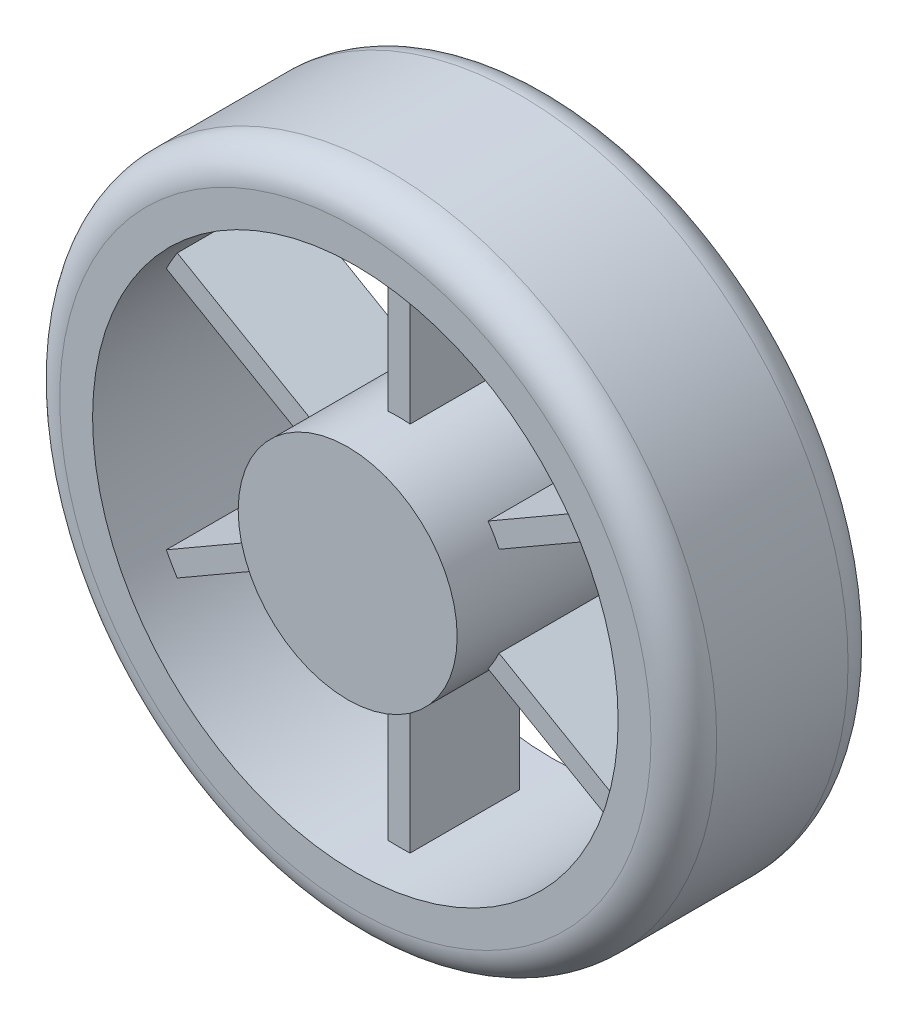
ISO-10303-21;
HEADER;
FILE_DESCRIPTION(('STEP AP214'),'2;1');
FILE_NAME('part.step','',(''),(''),'','','');
FILE_SCHEMA(('AUTOMOTIVE_DESIGN { 1 0 10303 214 1 1 1 1 }'));
ENDSEC;
DATA;
#1=APPLICATION_CONTEXT('core data for automotive mechanical design processes');
#2=APPLICATION_PROTOCOL_DEFINITION('international standard','automotive_design',2000,#1);
#3=PRODUCT_CONTEXT('',#1,'mechanical');
#4=PRODUCT('Part','Part','',(#3));
#5=PRODUCT_RELATED_PRODUCT_CATEGORY('part','',(#4));
#6=PRODUCT_DEFINITION_FORMATION('','',#4);
#7=PRODUCT_DEFINITION_CONTEXT('part definition',#1,'design');
#8=PRODUCT_DEFINITION('design','',#6,#7);
#9=PRODUCT_DEFINITION_SHAPE('','',#8);
#10=(LENGTH_UNIT() NAMED_UNIT(*) SI_UNIT(.MILLI.,.METRE.));
#11=(NAMED_UNIT(*) PLANE_ANGLE_UNIT() SI_UNIT($,.RADIAN.));
#12=(NAMED_UNIT(*) SI_UNIT($,.STERADIAN.) SOLID_ANGLE_UNIT());
#13=UNCERTAINTY_MEASURE_WITH_UNIT(LENGTH_MEASURE(1.E-05),#10,'distance_accuracy_value','');
#14=(GEOMETRIC_REPRESENTATION_CONTEXT(3) GLOBAL_UNCERTAINTY_ASSIGNED_CONTEXT((#13)) GLOBAL_UNIT_ASSIGNED_CONTEXT((#10,
#11,#12)) REPRESENTATION_CONTEXT('',''));
#15=CARTESIAN_POINT('',(0.,0.,0.));
#16=DIRECTION('',(0.,0.,1.));
#17=DIRECTION('',(1.,0.,0.));
#18=AXIS2_PLACEMENT_3D('',#15,#16,#17);
#19=CARTESIAN_POINT('',(0.,0.,48.5));
#20=DIRECTION('',(0.,0.,-1.));
#21=DIRECTION('',(-1.,0.,0.));
#22=AXIS2_PLACEMENT_3D('',#19,#20,#21);
#23=CYLINDRICAL_SURFACE('',#22,50.);
#24=DIRECTION('',(0.,0.,-1.));
#25=VECTOR('',#24,1.);
#26=CARTESIAN_POINT('',(45.584219849035,20.5445589087439,25.));
#27=LINE('',#26,#25);
#28=CARTESIAN_POINT('',(45.584219849035,20.5445589087439,25.));
#29=VERTEX_POINT('',#28);
#30=CARTESIAN_POINT('',(45.584219849035,20.5445589087439,-25.));
#31=VERTEX_POINT('',#30);
#32=EDGE_CURVE('E55',#29,#31,#27,.T.);
#33=ORIENTED_EDGE('',*,*,#32,.F.);
#34=CARTESIAN_POINT('',(0.,0.,25.));
#35=DIRECTION('',(0.,0.,-1.));
#36=DIRECTION('',(0.50000000000001,-0.866025403784433,0.));
#37=AXIS2_PLACEMENT_3D('',#34,#35,#36);
#38=CIRCLE('',#37,50.);
#39=CARTESIAN_POINT('',(40.5842198490349,29.2048129465882,25.));
#40=VERTEX_POINT('',#39);
#41=EDGE_CURVE('E50',#40,#29,#38,.T.);
#42=ORIENTED_EDGE('',*,*,#41,.F.);
#43=DIRECTION('',(0.,0.,-1.));
#44=VECTOR('',#43,1.);
#45=CARTESIAN_POINT('',(40.5842198490349,29.2048129465882,25.));
#46=LINE('',#45,#44);
#47=CARTESIAN_POINT('',(40.5842198490349,29.2048129465882,-25.));
#48=VERTEX_POINT('',#47);
#49=EDGE_CURVE('E200',#40,#48,#46,.T.);
#50=ORIENTED_EDGE('',*,*,#49,.T.);
#51=CARTESIAN_POINT('',(0.,0.,-25.));
#52=DIRECTION('',(0.,0.,-1.));
#53=DIRECTION('',(0.50000000000001,-0.866025403784433,0.));
#54=AXIS2_PLACEMENT_3D('',#51,#52,#53);
#55=CIRCLE('',#54,50.);
#56=EDGE_CURVE('E844',#48,#31,#55,.T.);
#57=ORIENTED_EDGE('',*,*,#56,.T.);
#58=EDGE_LOOP('',(#33,#42,#50,#57));
#59=FACE_BOUND('',#58,.T.);
#60=DIRECTION('',(0.,0.,-1.));
#61=VECTOR('',#60,1.);
#62=CARTESIAN_POINT('',(40.5842198490355,-29.2048129465873,25.));
#63=LINE('',#62,#61);
#64=CARTESIAN_POINT('',(40.5842198490355,-29.2048129465873,25.));
#65=VERTEX_POINT('',#64);
#66=CARTESIAN_POINT('',(40.5842198490355,-29.2048129465873,-25.));
#67=VERTEX_POINT('',#66);
#68=EDGE_CURVE('E246',#65,#67,#63,.T.);
#69=ORIENTED_EDGE('',*,*,#68,.F.);
#70=CARTESIAN_POINT('',(0.,0.,25.));
#71=DIRECTION('',(0.,0.,-1.));
#72=DIRECTION('',(-0.499999999999992,-0.866025403784443,0.));
#73=AXIS2_PLACEMENT_3D('',#70,#71,#72);
#74=CIRCLE('',#73,50.);
#75=CARTESIAN_POINT('',(45.5842198490354,-20.5445589087429,25.));
#76=VERTEX_POINT('',#75);
#77=EDGE_CURVE('E233',#76,#65,#74,.T.);
#78=ORIENTED_EDGE('',*,*,#77,.F.);
#79=DIRECTION('',(0.,0.,-1.));
#80=VECTOR('',#79,1.);
#81=CARTESIAN_POINT('',(45.5842198490354,-20.5445589087429,25.));
#82=LINE('',#81,#80);
#83=CARTESIAN_POINT('',(45.5842198490354,-20.5445589087429,-25.));
#84=VERTEX_POINT('',#83);
#85=EDGE_CURVE('E249',#76,#84,#82,.T.);
#86=ORIENTED_EDGE('',*,*,#85,.T.);
#87=CARTESIAN_POINT('',(0.,0.,-25.));
#88=DIRECTION('',(0.,0.,-1.));
#89=DIRECTION('',(-0.499999999999992,-0.866025403784443,0.));
#90=AXIS2_PLACEMENT_3D('',#87,#88,#89);
#91=CIRCLE('',#90,50.);
#92=EDGE_CURVE('E241',#84,#67,#91,.T.);
#93=ORIENTED_EDGE('',*,*,#92,.T.);
#94=EDGE_LOOP('',(#69,#78,#86,#93));
#95=FACE_BOUND('',#94,.T.);
#96=DIRECTION('',(0.,0.,-1.));
#97=VECTOR('',#96,1.);
#98=CARTESIAN_POINT('',(-4.99999999999999,-49.749371855331,25.));
#99=LINE('',#98,#97);
#100=CARTESIAN_POINT('',(-4.99999999999999,-49.749371855331,25.));
#101=VERTEX_POINT('',#100);
#102=CARTESIAN_POINT('',(-4.99999999999999,-49.749371855331,-25.));
#103=VERTEX_POINT('',#102);
#104=EDGE_CURVE('E277',#101,#103,#99,.T.);
#105=ORIENTED_EDGE('',*,*,#104,.F.);
#106=CARTESIAN_POINT('',(0.,0.,25.));
#107=DIRECTION('',(0.,0.,-1.));
#108=DIRECTION('',(-1.,0.,0.));
#109=AXIS2_PLACEMENT_3D('',#106,#107,#108);
#110=CIRCLE('',#109,50.);
#111=CARTESIAN_POINT('',(4.99999999999999,-49.749371855331,25.));
#112=VERTEX_POINT('',#111);
#113=EDGE_CURVE('E261',#112,#101,#110,.T.);
#114=ORIENTED_EDGE('',*,*,#113,.F.);
#115=DIRECTION('',(0.,0.,-1.));
#116=VECTOR('',#115,1.);
#117=CARTESIAN_POINT('',(4.99999999999999,-49.749371855331,25.));
#118=LINE('',#117,#116);
#119=CARTESIAN_POINT('',(4.99999999999999,-49.749371855331,-25.));
#120=VERTEX_POINT('',#119);
#121=EDGE_CURVE('E280',#112,#120,#118,.T.);
#122=ORIENTED_EDGE('',*,*,#121,.T.);
#123=CARTESIAN_POINT('',(0.,0.,-25.));
#124=DIRECTION('',(0.,0.,-1.));
#125=DIRECTION('',(-1.,0.,0.));
#126=AXIS2_PLACEMENT_3D('',#123,#124,#125);
#127=CIRCLE('',#126,50.);
#128=EDGE_CURVE('E272',#120,#103,#127,.T.);
#129=ORIENTED_EDGE('',*,*,#128,.T.);
#130=EDGE_LOOP('',(#105,#114,#122,#129));
#131=FACE_BOUND('',#130,.T.);
#132=DIRECTION('',(0.,0.,-1.));
#133=VECTOR('',#132,1.);
#134=CARTESIAN_POINT('',(-45.5842198490351,-20.5445589087435,25.));
#135=LINE('',#134,#133);
#136=CARTESIAN_POINT('',(-45.5842198490351,-20.5445589087435,25.));
#137=VERTEX_POINT('',#136);
#138=CARTESIAN_POINT('',(-45.5842198490351,-20.5445589087435,-25.));
#139=VERTEX_POINT('',#138);
#140=EDGE_CURVE('E308',#137,#139,#135,.T.);
#141=ORIENTED_EDGE('',*,*,#140,.F.);
#142=CARTESIAN_POINT('',(0.,0.,25.));
#143=DIRECTION('',(0.,0.,-1.));
#144=DIRECTION('',(-0.500000000000004,0.866025403784436,0.));
#145=AXIS2_PLACEMENT_3D('',#142,#143,#144);
#146=CIRCLE('',#145,50.);
#147=CARTESIAN_POINT('',(-40.5842198490351,-29.2048129465879,25.));
#148=VERTEX_POINT('',#147);
#149=EDGE_CURVE('E292',#148,#137,#146,.T.);
#150=ORIENTED_EDGE('',*,*,#149,.F.);
#151=DIRECTION('',(0.,0.,-1.));
#152=VECTOR('',#151,1.);
#153=CARTESIAN_POINT('',(-40.5842198490351,-29.2048129465879,25.));
#154=LINE('',#153,#152);
#155=CARTESIAN_POINT('',(-40.5842198490351,-29.2048129465879,-25.));
#156=VERTEX_POINT('',#155);
#157=EDGE_CURVE('E311',#148,#156,#154,.T.);
#158=ORIENTED_EDGE('',*,*,#157,.T.);
#159=CARTESIAN_POINT('',(0.,0.,-25.));
#160=DIRECTION('',(0.,0.,-1.));
#161=DIRECTION('',(-0.500000000000004,0.866025403784436,0.));
#162=AXIS2_PLACEMENT_3D('',#159,#160,#161);
#163=CIRCLE('',#162,50.);
#164=EDGE_CURVE('E303',#156,#139,#163,.T.);
#165=ORIENTED_EDGE('',*,*,#164,.T.);
#166=EDGE_LOOP('',(#141,#150,#158,#165));
#167=FACE_BOUND('',#166,.T.);
#168=DIRECTION('',(0.,0.,-1.));
#169=VECTOR('',#168,1.);
#170=CARTESIAN_POINT('',(-40.5842198490353,29.2048129465876,25.));
#171=LINE('',#170,#169);
#172=CARTESIAN_POINT('',(-40.5842198490353,29.2048129465876,25.));
#173=VERTEX_POINT('',#172);
#174=CARTESIAN_POINT('',(-40.5842198490353,29.2048129465876,-25.));
#175=VERTEX_POINT('',#174);
#176=EDGE_CURVE('E339',#173,#175,#171,.T.);
#177=ORIENTED_EDGE('',*,*,#176,.F.);
#178=CARTESIAN_POINT('',(0.,0.,25.));
#179=DIRECTION('',(0.,0.,-1.));
#180=DIRECTION('',(0.499999999999998,0.86602540378444,0.));
#181=AXIS2_PLACEMENT_3D('',#178,#179,#180);
#182=CIRCLE('',#181,50.);
#183=CARTESIAN_POINT('',(-45.5842198490353,20.5445589087432,25.));
#184=VERTEX_POINT('',#183);
#185=EDGE_CURVE('E323',#184,#173,#182,.T.);
#186=ORIENTED_EDGE('',*,*,#185,.F.);
#187=DIRECTION('',(0.,0.,-1.));
#188=VECTOR('',#187,1.);
#189=CARTESIAN_POINT('',(-45.5842198490353,20.5445589087432,25.));
#190=LINE('',#189,#188);
#191=CARTESIAN_POINT('',(-45.5842198490353,20.5445589087432,-25.));
#192=VERTEX_POINT('',#191);
#193=EDGE_CURVE('E342',#184,#192,#190,.T.);
#194=ORIENTED_EDGE('',*,*,#193,.T.);
#195=CARTESIAN_POINT('',(0.,0.,-25.));
#196=DIRECTION('',(0.,0.,-1.));
#197=DIRECTION('',(0.499999999999998,0.86602540378444,0.));
#198=AXIS2_PLACEMENT_3D('',#195,#196,#197);
#199=CIRCLE('',#198,50.);
#200=EDGE_CURVE('E334',#192,#175,#199,.T.);
#201=ORIENTED_EDGE('',*,*,#200,.T.);
#202=EDGE_LOOP('',(#177,#186,#194,#201));
#203=FACE_BOUND('',#202,.T.);
#204=DIRECTION('',(0.,0.,-1.));
#205=VECTOR('',#204,1.);
#206=CARTESIAN_POINT('',(4.99999999999999,49.749371855331,25.));
#207=LINE('',#206,#205);
#208=CARTESIAN_POINT('',(4.99999999999999,49.749371855331,25.));
#209=VERTEX_POINT('',#208);
#210=CARTESIAN_POINT('',(4.99999999999999,49.749371855331,-25.));
#211=VERTEX_POINT('',#210);
#212=EDGE_CURVE('E376',#209,#211,#207,.T.);
#213=ORIENTED_EDGE('',*,*,#212,.F.);
#214=CARTESIAN_POINT('',(0.,0.,25.));
#215=DIRECTION('',(0.,0.,-1.));
#216=DIRECTION('',(1.,0.,0.));
#217=AXIS2_PLACEMENT_3D('',#214,#215,#216);
#218=CIRCLE('',#217,50.);
#219=CARTESIAN_POINT('',(-4.99999999999999,49.749371855331,25.));
#220=VERTEX_POINT('',#219);
#221=EDGE_CURVE('E360',#220,#209,#218,.T.);
#222=ORIENTED_EDGE('',*,*,#221,.F.);
#223=DIRECTION('',(0.,0.,-1.));
#224=VECTOR('',#223,1.);
#225=CARTESIAN_POINT('',(-4.99999999999999,49.749371855331,25.));
#226=LINE('',#225,#224);
#227=CARTESIAN_POINT('',(-4.99999999999999,49.749371855331,-25.));
#228=VERTEX_POINT('',#227);
#229=EDGE_CURVE('E379',#220,#228,#226,.T.);
#230=ORIENTED_EDGE('',*,*,#229,.T.);
#231=CARTESIAN_POINT('',(0.,0.,-25.));
#232=DIRECTION('',(0.,0.,-1.));
#233=DIRECTION('',(1.,0.,0.));
#234=AXIS2_PLACEMENT_3D('',#231,#232,#233);
#235=CIRCLE('',#234,50.);
#236=EDGE_CURVE('E371',#228,#211,#235,.T.);
#237=ORIENTED_EDGE('',*,*,#236,.T.);
#238=EDGE_LOOP('',(#213,#222,#230,#237));
#239=FACE_BOUND('',#238,.T.);
#240=CARTESIAN_POINT('',(0.,0.,48.5));
#241=DIRECTION('',(0.,0.,1.));
#242=DIRECTION('',(1.,0.,0.));
#243=AXIS2_PLACEMENT_3D('',#240,#241,#242);
#244=CIRCLE('',#243,50.);
#245=CARTESIAN_POINT('',(50.,0.,48.5));
#246=VERTEX_POINT('',#245);
#247=EDGE_CURVE('E384',#246,#246,#244,.T.);
#248=ORIENTED_EDGE('',*,*,#247,.F.);
#249=EDGE_LOOP('',(#248));
#250=FACE_BOUND('',#249,.T.);
#251=CARTESIAN_POINT('',(0.,0.,-48.5));
#252=DIRECTION('',(0.,0.,1.));
#253=DIRECTION('',(1.,0.,0.));
#254=AXIS2_PLACEMENT_3D('',#251,#252,#253);
#255=CIRCLE('',#254,50.);
#256=CARTESIAN_POINT('',(50.,0.,-48.5));
#257=VERTEX_POINT('',#256);
#258=EDGE_CURVE('E383',#257,#257,#255,.T.);
#259=ORIENTED_EDGE('',*,*,#258,.T.);
#260=EDGE_LOOP('',(#259));
#261=FACE_BOUND('',#260,.T.);
#262=ADVANCED_FACE('F35',(#59,#95,#131,#167,#203,#239,#250,#261),#23,.T.);
#263=CARTESIAN_POINT('',(0.,0.,48.5));
#264=DIRECTION('',(0.,0.,1.));
#265=DIRECTION('',(1.,0.,0.));
#266=AXIS2_PLACEMENT_3D('',#263,#264,#265);
#267=PLANE('',#266);
#268=ORIENTED_EDGE('',*,*,#247,.T.);
#269=EDGE_LOOP('',(#268));
#270=FACE_BOUND('',#269,.T.);
#271=ADVANCED_FACE('F433',(#270),#267,.T.);
#272=CARTESIAN_POINT('',(0.,0.,-48.5));
#273=DIRECTION('',(0.,0.,1.));
#274=DIRECTION('',(1.,0.,0.));
#275=AXIS2_PLACEMENT_3D('',#272,#273,#274);
#276=PLANE('',#275);
#277=ORIENTED_EDGE('',*,*,#258,.F.);
#278=EDGE_LOOP('',(#277));
#279=FACE_BOUND('',#278,.T.);
#280=ADVANCED_FACE('F438',(#279),#276,.F.);
#281=CARTESIAN_POINT('',(-5.,119.895788082818,25.));
#282=DIRECTION('',(1.,0.,0.));
#283=DIRECTION('',(0.,1.,0.));
#284=AXIS2_PLACEMENT_3D('',#281,#282,#283);
#285=PLANE('',#284);
#286=DIRECTION('',(0.,-1.,0.));
#287=VECTOR('',#286,1.);
#288=CARTESIAN_POINT('',(-5.,119.895788082818,-25.));
#289=LINE('',#288,#287);
#290=CARTESIAN_POINT('',(-5.,119.895788082818,-25.));
#291=VERTEX_POINT('',#290);
#292=EDGE_CURVE('E368',#291,#228,#289,.T.);
#293=ORIENTED_EDGE('',*,*,#292,.T.);
#294=ORIENTED_EDGE('',*,*,#229,.F.);
#295=DIRECTION('',(0.,-1.,0.));
#296=VECTOR('',#295,1.);
#297=CARTESIAN_POINT('',(-5.,119.895788082818,25.));
#298=LINE('',#297,#296);
#299=CARTESIAN_POINT('',(-5.,119.895788082818,25.));
#300=VERTEX_POINT('',#299);
#301=EDGE_CURVE('E356',#300,#220,#298,.T.);
#302=ORIENTED_EDGE('',*,*,#301,.F.);
#303=DIRECTION('',(0.,0.,-1.));
#304=VECTOR('',#303,1.);
#305=CARTESIAN_POINT('',(-5.,119.895788082818,25.));
#306=LINE('',#305,#304);
#307=EDGE_CURVE('E381',#300,#291,#306,.T.);
#308=ORIENTED_EDGE('',*,*,#307,.T.);
#309=EDGE_LOOP('',(#293,#294,#302,#308));
#310=FACE_BOUND('',#309,.T.);
#311=ADVANCED_FACE('F444',(#310),#285,.F.);
#312=CARTESIAN_POINT('',(5.,119.895788082818,25.));
#313=DIRECTION('',(-1.,0.,0.));
#314=DIRECTION('',(0.,-1.,0.));
#315=AXIS2_PLACEMENT_3D('',#312,#313,#314);
#316=PLANE('',#315);
#317=DIRECTION('',(0.,1.,0.));
#318=VECTOR('',#317,1.);
#319=CARTESIAN_POINT('',(5.,119.895788082818,-25.));
#320=LINE('',#319,#318);
#321=CARTESIAN_POINT('',(5.,119.895788082818,-25.));
#322=VERTEX_POINT('',#321);
#323=EDGE_CURVE('E357',#211,#322,#320,.T.);
#324=ORIENTED_EDGE('',*,*,#323,.T.);
#325=DIRECTION('',(0.,0.,-1.));
#326=VECTOR('',#325,1.);
#327=CARTESIAN_POINT('',(5.,119.895788082818,25.));
#328=LINE('',#327,#326);
#329=CARTESIAN_POINT('',(5.,119.895788082818,25.));
#330=VERTEX_POINT('',#329);
#331=EDGE_CURVE('E365',#330,#322,#328,.T.);
#332=ORIENTED_EDGE('',*,*,#331,.F.);
#333=DIRECTION('',(0.,1.,0.));
#334=VECTOR('',#333,1.);
#335=CARTESIAN_POINT('',(5.,119.895788082818,25.));
#336=LINE('',#335,#334);
#337=EDGE_CURVE('E363',#209,#330,#336,.T.);
#338=ORIENTED_EDGE('',*,*,#337,.F.);
#339=ORIENTED_EDGE('',*,*,#212,.T.);
#340=EDGE_LOOP('',(#324,#332,#338,#339));
#341=FACE_BOUND('',#340,.T.);
#342=ADVANCED_FACE('F449',(#341),#316,.F.);
#343=CARTESIAN_POINT('',(0.,0.,25.));
#344=DIRECTION('',(0.,0.,1.));
#345=DIRECTION('',(1.,0.,0.));
#346=AXIS2_PLACEMENT_3D('',#343,#344,#345);
#347=PLANE('',#346);
#348=CARTESIAN_POINT('',(0.,0.,25.));
#349=DIRECTION('',(0.,0.,1.));
#350=DIRECTION('',(1.,0.,0.));
#351=AXIS2_PLACEMENT_3D('',#348,#349,#350);
#352=CIRCLE('',#351,120.);
#353=EDGE_CURVE('E353',#330,#300,#352,.T.);
#354=ORIENTED_EDGE('',*,*,#353,.T.);
#355=ORIENTED_EDGE('',*,*,#301,.T.);
#356=ORIENTED_EDGE('',*,*,#221,.T.);
#357=ORIENTED_EDGE('',*,*,#337,.T.);
#358=EDGE_LOOP('',(#354,#355,#356,#357));
#359=FACE_BOUND('',#358,.T.);
#360=ADVANCED_FACE('F453',(#359),#347,.T.);
#361=CARTESIAN_POINT('',(0.,0.,-25.));
#362=DIRECTION('',(0.,0.,1.));
#363=DIRECTION('',(1.,0.,0.));
#364=AXIS2_PLACEMENT_3D('',#361,#362,#363);
#365=PLANE('',#364);
#366=CARTESIAN_POINT('',(0.,0.,-25.));
#367=DIRECTION('',(0.,0.,1.));
#368=DIRECTION('',(1.,0.,0.));
#369=AXIS2_PLACEMENT_3D('',#366,#367,#368);
#370=CIRCLE('',#369,120.);
#371=EDGE_CURVE('E350',#322,#291,#370,.T.);
#372=ORIENTED_EDGE('',*,*,#371,.F.);
#373=ORIENTED_EDGE('',*,*,#323,.F.);
#374=ORIENTED_EDGE('',*,*,#236,.F.);
#375=ORIENTED_EDGE('',*,*,#292,.F.);
#376=EDGE_LOOP('',(#372,#373,#374,#375));
#377=FACE_BOUND('',#376,.T.);
#378=ADVANCED_FACE('F419',(#377),#365,.F.);
#379=CARTESIAN_POINT('',(0.,0.,45.));
#380=DIRECTION('',(0.,0.,1.));
#381=DIRECTION('',(1.,0.,0.));
#382=AXIS2_PLACEMENT_3D('',#379,#380,#381);
#383=PLANE('',#382);
#384=CARTESIAN_POINT('',(0.,0.,45.));
#385=DIRECTION('',(0.,0.,1.));
#386=DIRECTION('',(1.,0.,0.));
#387=AXIS2_PLACEMENT_3D('',#384,#385,#386);
#388=CIRCLE('',#387,135.);
#389=CARTESIAN_POINT('',(135.,0.,45.));
#390=VERTEX_POINT('',#389);
#391=EDGE_CURVE('E11',#390,#390,#388,.T.);
#392=ORIENTED_EDGE('',*,*,#391,.T.);
#393=EDGE_LOOP('',(#392));
#394=FACE_BOUND('',#393,.T.);
#395=CARTESIAN_POINT('',(0.,0.,45.));
#396=DIRECTION('',(0.,0.,1.));
#397=DIRECTION('',(1.,0.,0.));
#398=AXIS2_PLACEMENT_3D('',#395,#396,#397);
#399=CIRCLE('',#398,120.);
#400=CARTESIAN_POINT('',(120.,0.,45.));
#401=VERTEX_POINT('',#400);
#402=EDGE_CURVE('E347',#401,#401,#399,.T.);
#403=ORIENTED_EDGE('',*,*,#402,.F.);
#404=EDGE_LOOP('',(#403));
#405=FACE_BOUND('',#404,.T.);
#406=ADVANCED_FACE('F416',(#394,#405),#383,.T.);
#407=CARTESIAN_POINT('',(0.,0.,-45.));
#408=DIRECTION('',(0.,0.,1.));
#409=DIRECTION('',(1.,0.,0.));
#410=AXIS2_PLACEMENT_3D('',#407,#408,#409);
#411=PLANE('',#410);
#412=CARTESIAN_POINT('',(0.,0.,-45.));
#413=DIRECTION('',(0.,0.,1.));
#414=DIRECTION('',(1.,0.,0.));
#415=AXIS2_PLACEMENT_3D('',#412,#413,#414);
#416=CIRCLE('',#415,135.);
#417=CARTESIAN_POINT('',(135.,0.,-45.));
#418=VERTEX_POINT('',#417);
#419=EDGE_CURVE('E43',#418,#418,#416,.F.);
#420=ORIENTED_EDGE('',*,*,#419,.T.);
#421=EDGE_LOOP('',(#420));
#422=FACE_BOUND('',#421,.T.);
#423=CARTESIAN_POINT('',(0.,0.,-45.));
#424=DIRECTION('',(0.,0.,1.));
#425=DIRECTION('',(1.,0.,0.));
#426=AXIS2_PLACEMENT_3D('',#423,#424,#425);
#427=CIRCLE('',#426,120.);
#428=CARTESIAN_POINT('',(120.,0.,-45.));
#429=VERTEX_POINT('',#428);
#430=EDGE_CURVE('E346',#429,#429,#427,.T.);
#431=ORIENTED_EDGE('',*,*,#430,.T.);
#432=EDGE_LOOP('',(#431));
#433=FACE_BOUND('',#432,.T.);
#434=ADVANCED_FACE('F397',(#422,#433),#411,.F.);
#435=CARTESIAN_POINT('',(0.,0.,45.));
#436=DIRECTION('',(0.,0.,-1.));
#437=DIRECTION('',(-1.,0.,0.));
#438=AXIS2_PLACEMENT_3D('',#435,#436,#437);
#439=CYLINDRICAL_SURFACE('',#438,150.);
#440=CARTESIAN_POINT('',(0.,0.,-30.));
#441=DIRECTION('',(0.,0.,1.));
#442=DIRECTION('',(1.,0.,0.));
#443=AXIS2_PLACEMENT_3D('',#440,#441,#442);
#444=CIRCLE('',#443,150.);
#445=CARTESIAN_POINT('',(150.,0.,-30.));
#446=VERTEX_POINT('',#445);
#447=EDGE_CURVE('E392',#446,#446,#444,.T.);
#448=ORIENTED_EDGE('',*,*,#447,.T.);
#449=EDGE_LOOP('',(#448));
#450=FACE_BOUND('',#449,.T.);
#451=CARTESIAN_POINT('',(0.,0.,30.));
#452=DIRECTION('',(0.,0.,1.));
#453=DIRECTION('',(1.,0.,0.));
#454=AXIS2_PLACEMENT_3D('',#451,#452,#453);
#455=CIRCLE('',#454,150.);
#456=CARTESIAN_POINT('',(150.,0.,30.));
#457=VERTEX_POINT('',#456);
#458=EDGE_CURVE('E387',#457,#457,#455,.F.);
#459=ORIENTED_EDGE('',*,*,#458,.T.);
#460=EDGE_LOOP('',(#459));
#461=FACE_BOUND('',#460,.T.);
#462=ADVANCED_FACE('F406',(#450,#461),#439,.T.);
#463=CARTESIAN_POINT('',(0.,0.,45.));
#464=DIRECTION('',(0.,0.,-1.));
#465=DIRECTION('',(-1.,0.,0.));
#466=AXIS2_PLACEMENT_3D('',#463,#464,#465);
#467=CYLINDRICAL_SURFACE('',#466,120.);
#468=CARTESIAN_POINT('',(0.,0.,25.));
#469=DIRECTION('',(0.,0.,1.));
#470=DIRECTION('',(0.50000000000001,-0.866025403784433,0.));
#471=AXIS2_PLACEMENT_3D('',#468,#469,#470);
#472=CIRCLE('',#471,120.);
#473=CARTESIAN_POINT('',(106.332798286475,55.617767022488,25.));
#474=VERTEX_POINT('',#473);
#475=CARTESIAN_POINT('',(101.332798286475,64.2780210603324,25.));
#476=VERTEX_POINT('',#475);
#477=EDGE_CURVE('E202',#474,#476,#472,.T.);
#478=ORIENTED_EDGE('',*,*,#477,.F.);
#479=DIRECTION('',(0.,0.,-1.));
#480=VECTOR('',#479,1.);
#481=CARTESIAN_POINT('',(106.332798286475,55.617767022488,25.));
#482=LINE('',#481,#480);
#483=CARTESIAN_POINT('',(106.332798286475,55.617767022488,-25.));
#484=VERTEX_POINT('',#483);
#485=EDGE_CURVE('E842',#474,#484,#482,.T.);
#486=ORIENTED_EDGE('',*,*,#485,.T.);
#487=CARTESIAN_POINT('',(0.,0.,-25.));
#488=DIRECTION('',(0.,0.,1.));
#489=DIRECTION('',(0.50000000000001,-0.866025403784433,0.));
#490=AXIS2_PLACEMENT_3D('',#487,#488,#489);
#491=CIRCLE('',#490,120.);
#492=CARTESIAN_POINT('',(101.332798286475,64.2780210603324,-25.));
#493=VERTEX_POINT('',#492);
#494=EDGE_CURVE('E217',#484,#493,#491,.T.);
#495=ORIENTED_EDGE('',*,*,#494,.T.);
#496=DIRECTION('',(0.,0.,-1.));
#497=VECTOR('',#496,1.);
#498=CARTESIAN_POINT('',(101.332798286475,64.2780210603324,25.));
#499=LINE('',#498,#497);
#500=EDGE_CURVE('E198',#476,#493,#499,.T.);
#501=ORIENTED_EDGE('',*,*,#500,.F.);
#502=EDGE_LOOP('',(#478,#486,#495,#501));
#503=FACE_BOUND('',#502,.T.);
#504=CARTESIAN_POINT('',(0.,0.,25.));
#505=DIRECTION('',(0.,0.,1.));
#506=DIRECTION('',(-0.499999999999992,-0.866025403784443,0.));
#507=AXIS2_PLACEMENT_3D('',#504,#505,#506);
#508=CIRCLE('',#507,120.);
#509=CARTESIAN_POINT('',(101.332798286477,-64.2780210603302,25.));
#510=VERTEX_POINT('',#509);
#511=CARTESIAN_POINT('',(106.332798286476,-55.6177670224858,25.));
#512=VERTEX_POINT('',#511);
#513=EDGE_CURVE('E226',#510,#512,#508,.T.);
#514=ORIENTED_EDGE('',*,*,#513,.F.);
#515=DIRECTION('',(0.,0.,-1.));
#516=VECTOR('',#515,1.);
#517=CARTESIAN_POINT('',(101.332798286477,-64.2780210603302,25.));
#518=LINE('',#517,#516);
#519=CARTESIAN_POINT('',(101.332798286477,-64.2780210603302,-25.));
#520=VERTEX_POINT('',#519);
#521=EDGE_CURVE('E237',#510,#520,#518,.T.);
#522=ORIENTED_EDGE('',*,*,#521,.T.);
#523=CARTESIAN_POINT('',(0.,0.,-25.));
#524=DIRECTION('',(0.,0.,1.));
#525=DIRECTION('',(-0.499999999999992,-0.866025403784443,0.));
#526=AXIS2_PLACEMENT_3D('',#523,#524,#525);
#527=CIRCLE('',#526,120.);
#528=CARTESIAN_POINT('',(106.332798286476,-55.6177670224858,-25.));
#529=VERTEX_POINT('',#528);
#530=EDGE_CURVE('E218',#520,#529,#527,.T.);
#531=ORIENTED_EDGE('',*,*,#530,.T.);
#532=DIRECTION('',(0.,0.,-1.));
#533=VECTOR('',#532,1.);
#534=CARTESIAN_POINT('',(106.332798286476,-55.6177670224858,25.));
#535=LINE('',#534,#533);
#536=EDGE_CURVE('E251',#512,#529,#535,.T.);
#537=ORIENTED_EDGE('',*,*,#536,.F.);
#538=EDGE_LOOP('',(#514,#522,#531,#537));
#539=FACE_BOUND('',#538,.T.);
#540=CARTESIAN_POINT('',(0.,0.,25.));
#541=DIRECTION('',(0.,0.,1.));
#542=DIRECTION('',(-1.,0.,0.));
#543=AXIS2_PLACEMENT_3D('',#540,#541,#542);
#544=CIRCLE('',#543,120.);
#545=CARTESIAN_POINT('',(-5.,-119.895788082818,25.));
#546=VERTEX_POINT('',#545);
#547=CARTESIAN_POINT('',(5.,-119.895788082818,25.));
#548=VERTEX_POINT('',#547);
#549=EDGE_CURVE('E254',#546,#548,#544,.T.);
#550=ORIENTED_EDGE('',*,*,#549,.F.);
#551=DIRECTION('',(0.,0.,-1.));
#552=VECTOR('',#551,1.);
#553=CARTESIAN_POINT('',(-5.,-119.895788082818,25.));
#554=LINE('',#553,#552);
#555=CARTESIAN_POINT('',(-5.,-119.895788082818,-25.));
#556=VERTEX_POINT('',#555);
#557=EDGE_CURVE('E266',#546,#556,#554,.T.);
#558=ORIENTED_EDGE('',*,*,#557,.T.);
#559=CARTESIAN_POINT('',(0.,0.,-25.));
#560=DIRECTION('',(0.,0.,1.));
#561=DIRECTION('',(-1.,0.,0.));
#562=AXIS2_PLACEMENT_3D('',#559,#560,#561);
#563=CIRCLE('',#562,120.);
#564=CARTESIAN_POINT('',(5.,-119.895788082818,-25.));
#565=VERTEX_POINT('',#564);
#566=EDGE_CURVE('E253',#556,#565,#563,.T.);
#567=ORIENTED_EDGE('',*,*,#566,.T.);
#568=DIRECTION('',(0.,0.,-1.));
#569=VECTOR('',#568,1.);
#570=CARTESIAN_POINT('',(5.,-119.895788082818,25.));
#571=LINE('',#570,#569);
#572=EDGE_CURVE('E282',#548,#565,#571,.T.);
#573=ORIENTED_EDGE('',*,*,#572,.F.);
#574=EDGE_LOOP('',(#550,#558,#567,#573));
#575=FACE_BOUND('',#574,.T.);
#576=CARTESIAN_POINT('',(0.,0.,25.));
#577=DIRECTION('',(0.,0.,1.));
#578=DIRECTION('',(-0.500000000000004,0.866025403784436,0.));
#579=AXIS2_PLACEMENT_3D('',#576,#577,#578);
#580=CIRCLE('',#579,120.);
#581=CARTESIAN_POINT('',(-106.332798286476,-55.6177670224873,25.));
#582=VERTEX_POINT('',#581);
#583=CARTESIAN_POINT('',(-101.332798286476,-64.2780210603317,25.));
#584=VERTEX_POINT('',#583);
#585=EDGE_CURVE('E285',#582,#584,#580,.T.);
#586=ORIENTED_EDGE('',*,*,#585,.F.);
#587=DIRECTION('',(0.,0.,-1.));
#588=VECTOR('',#587,1.);
#589=CARTESIAN_POINT('',(-106.332798286476,-55.6177670224873,25.));
#590=LINE('',#589,#588);
#591=CARTESIAN_POINT('',(-106.332798286476,-55.6177670224873,-25.));
#592=VERTEX_POINT('',#591);
#593=EDGE_CURVE('E297',#582,#592,#590,.T.);
#594=ORIENTED_EDGE('',*,*,#593,.T.);
#595=CARTESIAN_POINT('',(0.,0.,-25.));
#596=DIRECTION('',(0.,0.,1.));
#597=DIRECTION('',(-0.500000000000004,0.866025403784436,0.));
#598=AXIS2_PLACEMENT_3D('',#595,#596,#597);
#599=CIRCLE('',#598,120.);
#600=CARTESIAN_POINT('',(-101.332798286476,-64.2780210603317,-25.));
#601=VERTEX_POINT('',#600);
#602=EDGE_CURVE('E284',#592,#601,#599,.T.);
#603=ORIENTED_EDGE('',*,*,#602,.T.);
#604=DIRECTION('',(0.,0.,-1.));
#605=VECTOR('',#604,1.);
#606=CARTESIAN_POINT('',(-101.332798286476,-64.2780210603317,25.));
#607=LINE('',#606,#605);
#608=EDGE_CURVE('E313',#584,#601,#607,.T.);
#609=ORIENTED_EDGE('',*,*,#608,.F.);
#610=EDGE_LOOP('',(#586,#594,#603,#609));
#611=FACE_BOUND('',#610,.T.);
#612=CARTESIAN_POINT('',(0.,0.,25.));
#613=DIRECTION('',(0.,0.,1.));
#614=DIRECTION('',(0.499999999999998,0.86602540378444,0.));
#615=AXIS2_PLACEMENT_3D('',#612,#613,#614);
#616=CIRCLE('',#615,120.);
#617=CARTESIAN_POINT('',(-101.332798286476,64.2780210603309,25.));
#618=VERTEX_POINT('',#617);
#619=CARTESIAN_POINT('',(-106.332798286476,55.6177670224865,25.));
#620=VERTEX_POINT('',#619);
#621=EDGE_CURVE('E316',#618,#620,#616,.T.);
#622=ORIENTED_EDGE('',*,*,#621,.F.);
#623=DIRECTION('',(0.,0.,-1.));
#624=VECTOR('',#623,1.);
#625=CARTESIAN_POINT('',(-101.332798286476,64.2780210603309,25.));
#626=LINE('',#625,#624);
#627=CARTESIAN_POINT('',(-101.332798286476,64.2780210603309,-25.));
#628=VERTEX_POINT('',#627);
#629=EDGE_CURVE('E328',#618,#628,#626,.T.);
#630=ORIENTED_EDGE('',*,*,#629,.T.);
#631=CARTESIAN_POINT('',(0.,0.,-25.));
#632=DIRECTION('',(0.,0.,1.));
#633=DIRECTION('',(0.499999999999998,0.86602540378444,0.));
#634=AXIS2_PLACEMENT_3D('',#631,#632,#633);
#635=CIRCLE('',#634,120.);
#636=CARTESIAN_POINT('',(-106.332798286476,55.6177670224865,-25.));
#637=VERTEX_POINT('',#636);
#638=EDGE_CURVE('E315',#628,#637,#635,.T.);
#639=ORIENTED_EDGE('',*,*,#638,.T.);
#640=DIRECTION('',(0.,0.,-1.));
#641=VECTOR('',#640,1.);
#642=CARTESIAN_POINT('',(-106.332798286476,55.6177670224865,25.));
#643=LINE('',#642,#641);
#644=EDGE_CURVE('E344',#620,#637,#643,.T.);
#645=ORIENTED_EDGE('',*,*,#644,.F.);
#646=EDGE_LOOP('',(#622,#630,#639,#645));
#647=FACE_BOUND('',#646,.T.);
#648=ORIENTED_EDGE('',*,*,#307,.F.);
#649=ORIENTED_EDGE('',*,*,#353,.F.);
#650=ORIENTED_EDGE('',*,*,#331,.T.);
#651=ORIENTED_EDGE('',*,*,#371,.T.);
#652=EDGE_LOOP('',(#648,#649,#650,#651));
#653=FACE_BOUND('',#652,.T.);
#654=ORIENTED_EDGE('',*,*,#402,.T.);
#655=EDGE_LOOP('',(#654));
#656=FACE_BOUND('',#655,.T.);
#657=ORIENTED_EDGE('',*,*,#430,.F.);
#658=EDGE_LOOP('',(#657));
#659=FACE_BOUND('',#658,.T.);
#660=ADVANCED_FACE('F214',(#503,#539,#575,#611,#647,#653,#656,#659),#467,.F.);
#661=CARTESIAN_POINT('',(-106.332798286476,55.6177670224865,25.));
#662=DIRECTION('',(0.499999999999998,0.86602540378444,0.));
#663=DIRECTION('',(-0.86602540378444,0.499999999999998,0.));
#664=AXIS2_PLACEMENT_3D('',#661,#662,#663);
#665=PLANE('',#664);
#666=DIRECTION('',(0.86602540378444,-0.499999999999998,0.));
#667=VECTOR('',#666,1.);
#668=CARTESIAN_POINT('',(-106.332798286476,55.6177670224865,-25.));
#669=LINE('',#668,#667);
#670=EDGE_CURVE('E331',#637,#192,#669,.T.);
#671=ORIENTED_EDGE('',*,*,#670,.T.);
#672=ORIENTED_EDGE('',*,*,#193,.F.);
#673=DIRECTION('',(0.86602540378444,-0.499999999999998,0.));
#674=VECTOR('',#673,1.);
#675=CARTESIAN_POINT('',(-106.332798286476,55.6177670224865,25.));
#676=LINE('',#675,#674);
#677=EDGE_CURVE('E319',#620,#184,#676,.T.);
#678=ORIENTED_EDGE('',*,*,#677,.F.);
#679=ORIENTED_EDGE('',*,*,#644,.T.);
#680=EDGE_LOOP('',(#671,#672,#678,#679));
#681=FACE_BOUND('',#680,.T.);
#682=ADVANCED_FACE('F425',(#681),#665,.F.);
#683=CARTESIAN_POINT('',(-101.332798286476,64.2780210603309,25.));
#684=DIRECTION('',(-0.499999999999998,-0.86602540378444,0.));
#685=DIRECTION('',(0.86602540378444,-0.499999999999998,0.));
#686=AXIS2_PLACEMENT_3D('',#683,#684,#685);
#687=PLANE('',#686);
#688=DIRECTION('',(-0.86602540378444,0.499999999999998,0.));
#689=VECTOR('',#688,1.);
#690=CARTESIAN_POINT('',(-101.332798286476,64.2780210603309,-25.));
#691=LINE('',#690,#689);
#692=EDGE_CURVE('E320',#175,#628,#691,.T.);
#693=ORIENTED_EDGE('',*,*,#692,.T.);
#694=ORIENTED_EDGE('',*,*,#629,.F.);
#695=DIRECTION('',(-0.86602540378444,0.499999999999998,0.));
#696=VECTOR('',#695,1.);
#697=CARTESIAN_POINT('',(-101.332798286476,64.2780210603309,25.));
#698=LINE('',#697,#696);
#699=EDGE_CURVE('E326',#173,#618,#698,.T.);
#700=ORIENTED_EDGE('',*,*,#699,.F.);
#701=ORIENTED_EDGE('',*,*,#176,.T.);
#702=EDGE_LOOP('',(#693,#694,#700,#701));
#703=FACE_BOUND('',#702,.T.);
#704=ADVANCED_FACE('F653',(#703),#687,.F.);
#705=CARTESIAN_POINT('',(0.,0.,25.));
#706=DIRECTION('',(0.,0.,1.));
#707=DIRECTION('',(0.499999999999998,0.86602540378444,0.));
#708=AXIS2_PLACEMENT_3D('',#705,#706,#707);
#709=PLANE('',#708);
#710=ORIENTED_EDGE('',*,*,#621,.T.);
#711=ORIENTED_EDGE('',*,*,#677,.T.);
#712=ORIENTED_EDGE('',*,*,#185,.T.);
#713=ORIENTED_EDGE('',*,*,#699,.T.);
#714=EDGE_LOOP('',(#710,#711,#712,#713));
#715=FACE_BOUND('',#714,.T.);
#716=ADVANCED_FACE('F645',(#715),#709,.T.);
#717=CARTESIAN_POINT('',(0.,0.,-25.));
#718=DIRECTION('',(0.,0.,1.));
#719=DIRECTION('',(0.499999999999998,0.86602540378444,0.));
#720=AXIS2_PLACEMENT_3D('',#717,#718,#719);
#721=PLANE('',#720);
#722=ORIENTED_EDGE('',*,*,#638,.F.);
#723=ORIENTED_EDGE('',*,*,#692,.F.);
#724=ORIENTED_EDGE('',*,*,#200,.F.);
#725=ORIENTED_EDGE('',*,*,#670,.F.);
#726=EDGE_LOOP('',(#722,#723,#724,#725));
#727=FACE_BOUND('',#726,.T.);
#728=ADVANCED_FACE('F637',(#727),#721,.F.);
#729=CARTESIAN_POINT('',(-101.332798286476,-64.2780210603317,25.));
#730=DIRECTION('',(-0.500000000000004,0.866025403784436,0.));
#731=DIRECTION('',(-0.866025403784436,-0.500000000000004,0.));
#732=AXIS2_PLACEMENT_3D('',#729,#730,#731);
#733=PLANE('',#732);
#734=DIRECTION('',(0.866025403784436,0.500000000000004,0.));
#735=VECTOR('',#734,1.);
#736=CARTESIAN_POINT('',(-101.332798286476,-64.2780210603317,-25.));
#737=LINE('',#736,#735);
#738=EDGE_CURVE('E300',#601,#156,#737,.T.);
#739=ORIENTED_EDGE('',*,*,#738,.T.);
#740=ORIENTED_EDGE('',*,*,#157,.F.);
#741=DIRECTION('',(0.866025403784436,0.500000000000004,0.));
#742=VECTOR('',#741,1.);
#743=CARTESIAN_POINT('',(-101.332798286476,-64.2780210603317,25.));
#744=LINE('',#743,#742);
#745=EDGE_CURVE('E288',#584,#148,#744,.T.);
#746=ORIENTED_EDGE('',*,*,#745,.F.);
#747=ORIENTED_EDGE('',*,*,#608,.T.);
#748=EDGE_LOOP('',(#739,#740,#746,#747));
#749=FACE_BOUND('',#748,.T.);
#750=ADVANCED_FACE('F631',(#749),#733,.F.);
#751=CARTESIAN_POINT('',(-106.332798286476,-55.6177670224873,25.));
#752=DIRECTION('',(0.500000000000004,-0.866025403784436,0.));
#753=DIRECTION('',(0.866025403784436,0.500000000000004,0.));
#754=AXIS2_PLACEMENT_3D('',#751,#752,#753);
#755=PLANE('',#754);
#756=DIRECTION('',(-0.866025403784437,-0.500000000000004,0.));
#757=VECTOR('',#756,1.);
#758=CARTESIAN_POINT('',(-106.332798286476,-55.6177670224873,-25.));
#759=LINE('',#758,#757);
#760=EDGE_CURVE('E289',#139,#592,#759,.T.);
#761=ORIENTED_EDGE('',*,*,#760,.T.);
#762=ORIENTED_EDGE('',*,*,#593,.F.);
#763=DIRECTION('',(-0.866025403784437,-0.500000000000004,0.));
#764=VECTOR('',#763,1.);
#765=CARTESIAN_POINT('',(-106.332798286476,-55.6177670224873,25.));
#766=LINE('',#765,#764);
#767=EDGE_CURVE('E295',#137,#582,#766,.T.);
#768=ORIENTED_EDGE('',*,*,#767,.F.);
#769=ORIENTED_EDGE('',*,*,#140,.T.);
#770=EDGE_LOOP('',(#761,#762,#768,#769));
#771=FACE_BOUND('',#770,.T.);
#772=ADVANCED_FACE('F623',(#771),#755,.F.);
#773=CARTESIAN_POINT('',(0.,0.,25.));
#774=DIRECTION('',(0.,0.,1.));
#775=DIRECTION('',(-0.500000000000004,0.866025403784436,0.));
#776=AXIS2_PLACEMENT_3D('',#773,#774,#775);
#777=PLANE('',#776);
#778=ORIENTED_EDGE('',*,*,#585,.T.);
#779=ORIENTED_EDGE('',*,*,#745,.T.);
#780=ORIENTED_EDGE('',*,*,#149,.T.);
#781=ORIENTED_EDGE('',*,*,#767,.T.);
#782=EDGE_LOOP('',(#778,#779,#780,#781));
#783=FACE_BOUND('',#782,.T.);
#784=ADVANCED_FACE('F615',(#783),#777,.T.);
#785=CARTESIAN_POINT('',(0.,0.,-25.));
#786=DIRECTION('',(0.,0.,1.));
#787=DIRECTION('',(-0.500000000000004,0.866025403784436,0.));
#788=AXIS2_PLACEMENT_3D('',#785,#786,#787);
#789=PLANE('',#788);
#790=ORIENTED_EDGE('',*,*,#602,.F.);
#791=ORIENTED_EDGE('',*,*,#760,.F.);
#792=ORIENTED_EDGE('',*,*,#164,.F.);
#793=ORIENTED_EDGE('',*,*,#738,.F.);
#794=EDGE_LOOP('',(#790,#791,#792,#793));
#795=FACE_BOUND('',#794,.T.);
#796=ADVANCED_FACE('F606',(#795),#789,.F.);
#797=CARTESIAN_POINT('',(5.,-119.895788082818,25.));
#798=DIRECTION('',(-1.,0.,0.));
#799=DIRECTION('',(0.,-1.,0.));
#800=AXIS2_PLACEMENT_3D('',#797,#798,#799);
#801=PLANE('',#800);
#802=DIRECTION('',(0.,1.,0.));
#803=VECTOR('',#802,1.);
#804=CARTESIAN_POINT('',(5.,-119.895788082818,-25.));
#805=LINE('',#804,#803);
#806=EDGE_CURVE('E269',#565,#120,#805,.T.);
#807=ORIENTED_EDGE('',*,*,#806,.T.);
#808=ORIENTED_EDGE('',*,*,#121,.F.);
#809=DIRECTION('',(0.,1.,0.));
#810=VECTOR('',#809,1.);
#811=CARTESIAN_POINT('',(5.,-119.895788082818,25.));
#812=LINE('',#811,#810);
#813=EDGE_CURVE('E257',#548,#112,#812,.T.);
#814=ORIENTED_EDGE('',*,*,#813,.F.);
#815=ORIENTED_EDGE('',*,*,#572,.T.);
#816=EDGE_LOOP('',(#807,#808,#814,#815));
#817=FACE_BOUND('',#816,.T.);
#818=ADVANCED_FACE('F599',(#817),#801,.F.);
#819=CARTESIAN_POINT('',(-5.,-119.895788082818,25.));
#820=DIRECTION('',(1.,0.,0.));
#821=DIRECTION('',(0.,1.,0.));
#822=AXIS2_PLACEMENT_3D('',#819,#820,#821);
#823=PLANE('',#822);
#824=DIRECTION('',(0.,-1.,0.));
#825=VECTOR('',#824,1.);
#826=CARTESIAN_POINT('',(-5.,-119.895788082818,-25.));
#827=LINE('',#826,#825);
#828=EDGE_CURVE('E258',#103,#556,#827,.T.);
#829=ORIENTED_EDGE('',*,*,#828,.T.);
#830=ORIENTED_EDGE('',*,*,#557,.F.);
#831=DIRECTION('',(0.,-1.,0.));
#832=VECTOR('',#831,1.);
#833=CARTESIAN_POINT('',(-5.,-119.895788082818,25.));
#834=LINE('',#833,#832);
#835=EDGE_CURVE('E264',#101,#546,#834,.T.);
#836=ORIENTED_EDGE('',*,*,#835,.F.);
#837=ORIENTED_EDGE('',*,*,#104,.T.);
#838=EDGE_LOOP('',(#829,#830,#836,#837));
#839=FACE_BOUND('',#838,.T.);
#840=ADVANCED_FACE('F591',(#839),#823,.F.);
#841=CARTESIAN_POINT('',(0.,0.,25.));
#842=DIRECTION('',(0.,0.,1.));
#843=DIRECTION('',(-1.,0.,0.));
#844=AXIS2_PLACEMENT_3D('',#841,#842,#843);
#845=PLANE('',#844);
#846=ORIENTED_EDGE('',*,*,#549,.T.);
#847=ORIENTED_EDGE('',*,*,#813,.T.);
#848=ORIENTED_EDGE('',*,*,#113,.T.);
#849=ORIENTED_EDGE('',*,*,#835,.T.);
#850=EDGE_LOOP('',(#846,#847,#848,#849));
#851=FACE_BOUND('',#850,.T.);
#852=ADVANCED_FACE('F583',(#851),#845,.T.);
#853=CARTESIAN_POINT('',(0.,0.,-25.));
#854=DIRECTION('',(0.,0.,1.));
#855=DIRECTION('',(-1.,0.,0.));
#856=AXIS2_PLACEMENT_3D('',#853,#854,#855);
#857=PLANE('',#856);
#858=ORIENTED_EDGE('',*,*,#566,.F.);
#859=ORIENTED_EDGE('',*,*,#828,.F.);
#860=ORIENTED_EDGE('',*,*,#128,.F.);
#861=ORIENTED_EDGE('',*,*,#806,.F.);
#862=EDGE_LOOP('',(#858,#859,#860,#861));
#863=FACE_BOUND('',#862,.T.);
#864=ADVANCED_FACE('F574',(#863),#857,.F.);
#865=CARTESIAN_POINT('',(106.332798286476,-55.6177670224858,25.));
#866=DIRECTION('',(-0.499999999999992,-0.866025403784443,0.));
#867=DIRECTION('',(0.866025403784443,-0.499999999999992,0.));
#868=AXIS2_PLACEMENT_3D('',#865,#866,#867);
#869=PLANE('',#868);
#870=DIRECTION('',(-0.866025403784443,0.499999999999992,0.));
#871=VECTOR('',#870,1.);
#872=CARTESIAN_POINT('',(106.332798286476,-55.6177670224858,-25.));
#873=LINE('',#872,#871);
#874=EDGE_CURVE('E221',#529,#84,#873,.T.);
#875=ORIENTED_EDGE('',*,*,#874,.T.);
#876=ORIENTED_EDGE('',*,*,#85,.F.);
#877=DIRECTION('',(-0.866025403784443,0.499999999999992,0.));
#878=VECTOR('',#877,1.);
#879=CARTESIAN_POINT('',(106.332798286476,-55.6177670224858,25.));
#880=LINE('',#879,#878);
#881=EDGE_CURVE('E229',#512,#76,#880,.T.);
#882=ORIENTED_EDGE('',*,*,#881,.F.);
#883=ORIENTED_EDGE('',*,*,#536,.T.);
#884=EDGE_LOOP('',(#875,#876,#882,#883));
#885=FACE_BOUND('',#884,.T.);
#886=ADVANCED_FACE('F567',(#885),#869,.F.);
#887=CARTESIAN_POINT('',(101.332798286477,-64.2780210603302,25.));
#888=DIRECTION('',(0.499999999999992,0.866025403784443,0.));
#889=DIRECTION('',(-0.866025403784443,0.499999999999992,0.));
#890=AXIS2_PLACEMENT_3D('',#887,#888,#889);
#891=PLANE('',#890);
#892=DIRECTION('',(0.866025403784443,-0.499999999999992,0.));
#893=VECTOR('',#892,1.);
#894=CARTESIAN_POINT('',(101.332798286477,-64.2780210603302,-25.));
#895=LINE('',#894,#893);
#896=EDGE_CURVE('E230',#67,#520,#895,.T.);
#897=ORIENTED_EDGE('',*,*,#896,.T.);
#898=ORIENTED_EDGE('',*,*,#521,.F.);
#899=DIRECTION('',(0.866025403784443,-0.499999999999992,0.));
#900=VECTOR('',#899,1.);
#901=CARTESIAN_POINT('',(101.332798286477,-64.2780210603302,25.));
#902=LINE('',#901,#900);
#903=EDGE_CURVE('E236',#65,#510,#902,.T.);
#904=ORIENTED_EDGE('',*,*,#903,.F.);
#905=ORIENTED_EDGE('',*,*,#68,.T.);
#906=EDGE_LOOP('',(#897,#898,#904,#905));
#907=FACE_BOUND('',#906,.T.);
#908=ADVANCED_FACE('F559',(#907),#891,.F.);
#909=CARTESIAN_POINT('',(0.,0.,25.));
#910=DIRECTION('',(0.,0.,1.));
#911=DIRECTION('',(-0.499999999999992,-0.866025403784443,0.));
#912=AXIS2_PLACEMENT_3D('',#909,#910,#911);
#913=PLANE('',#912);
#914=ORIENTED_EDGE('',*,*,#513,.T.);
#915=ORIENTED_EDGE('',*,*,#881,.T.);
#916=ORIENTED_EDGE('',*,*,#77,.T.);
#917=ORIENTED_EDGE('',*,*,#903,.T.);
#918=EDGE_LOOP('',(#914,#915,#916,#917));
#919=FACE_BOUND('',#918,.T.);
#920=ADVANCED_FACE('F551',(#919),#913,.T.);
#921=CARTESIAN_POINT('',(0.,0.,-25.));
#922=DIRECTION('',(0.,0.,1.));
#923=DIRECTION('',(-0.499999999999992,-0.866025403784443,0.));
#924=AXIS2_PLACEMENT_3D('',#921,#922,#923);
#925=PLANE('',#924);
#926=ORIENTED_EDGE('',*,*,#530,.F.);
#927=ORIENTED_EDGE('',*,*,#896,.F.);
#928=ORIENTED_EDGE('',*,*,#92,.F.);
#929=ORIENTED_EDGE('',*,*,#874,.F.);
#930=EDGE_LOOP('',(#926,#927,#928,#929));
#931=FACE_BOUND('',#930,.T.);
#932=ADVANCED_FACE('F542',(#931),#925,.F.);
#933=CARTESIAN_POINT('',(101.332798286475,64.2780210603324,25.));
#934=DIRECTION('',(0.50000000000001,-0.866025403784433,0.));
#935=DIRECTION('',(0.866025403784433,0.50000000000001,0.));
#936=AXIS2_PLACEMENT_3D('',#933,#934,#935);
#937=PLANE('',#936);
#938=DIRECTION('',(-0.866025403784433,-0.50000000000001,0.));
#939=VECTOR('',#938,1.);
#940=CARTESIAN_POINT('',(101.332798286475,64.2780210603324,-25.));
#941=LINE('',#940,#939);
#942=EDGE_CURVE('E846',#493,#48,#941,.T.);
#943=ORIENTED_EDGE('',*,*,#942,.T.);
#944=ORIENTED_EDGE('',*,*,#49,.F.);
#945=DIRECTION('',(-0.866025403784433,-0.50000000000001,0.));
#946=VECTOR('',#945,1.);
#947=CARTESIAN_POINT('',(101.332798286475,64.2780210603324,25.));
#948=LINE('',#947,#946);
#949=EDGE_CURVE('E193',#476,#40,#948,.T.);
#950=ORIENTED_EDGE('',*,*,#949,.F.);
#951=ORIENTED_EDGE('',*,*,#500,.T.);
#952=EDGE_LOOP('',(#943,#944,#950,#951));
#953=FACE_BOUND('',#952,.T.);
#954=ADVANCED_FACE('F196',(#953),#937,.F.);
#955=CARTESIAN_POINT('',(106.332798286475,55.617767022488,25.));
#956=DIRECTION('',(-0.50000000000001,0.866025403784433,0.));
#957=DIRECTION('',(-0.866025403784433,-0.50000000000001,0.));
#958=AXIS2_PLACEMENT_3D('',#955,#956,#957);
#959=PLANE('',#958);
#960=DIRECTION('',(0.866025403784433,0.50000000000001,0.));
#961=VECTOR('',#960,1.);
#962=CARTESIAN_POINT('',(106.332798286475,55.617767022488,-25.));
#963=LINE('',#962,#961);
#964=EDGE_CURVE('E211',#31,#484,#963,.T.);
#965=ORIENTED_EDGE('',*,*,#964,.T.);
#966=ORIENTED_EDGE('',*,*,#485,.F.);
#967=DIRECTION('',(0.866025403784433,0.50000000000001,0.));
#968=VECTOR('',#967,1.);
#969=CARTESIAN_POINT('',(106.332798286475,55.617767022488,25.));
#970=LINE('',#969,#968);
#971=EDGE_CURVE('E207',#29,#474,#970,.T.);
#972=ORIENTED_EDGE('',*,*,#971,.F.);
#973=ORIENTED_EDGE('',*,*,#32,.T.);
#974=EDGE_LOOP('',(#965,#966,#972,#973));
#975=FACE_BOUND('',#974,.T.);
#976=ADVANCED_FACE('F526',(#975),#959,.F.);
#977=CARTESIAN_POINT('',(0.,0.,25.));
#978=DIRECTION('',(0.,0.,1.));
#979=DIRECTION('',(0.50000000000001,-0.866025403784433,0.));
#980=AXIS2_PLACEMENT_3D('',#977,#978,#979);
#981=PLANE('',#980);
#982=ORIENTED_EDGE('',*,*,#477,.T.);
#983=ORIENTED_EDGE('',*,*,#949,.T.);
#984=ORIENTED_EDGE('',*,*,#41,.T.);
#985=ORIENTED_EDGE('',*,*,#971,.T.);
#986=EDGE_LOOP('',(#982,#983,#984,#985));
#987=FACE_BOUND('',#986,.T.);
#988=ADVANCED_FACE('F205',(#987),#981,.T.);
#989=CARTESIAN_POINT('',(0.,0.,-25.));
#990=DIRECTION('',(0.,0.,1.));
#991=DIRECTION('',(0.50000000000001,-0.866025403784433,0.));
#992=AXIS2_PLACEMENT_3D('',#989,#990,#991);
#993=PLANE('',#992);
#994=ORIENTED_EDGE('',*,*,#494,.F.);
#995=ORIENTED_EDGE('',*,*,#964,.F.);
#996=ORIENTED_EDGE('',*,*,#56,.F.);
#997=ORIENTED_EDGE('',*,*,#942,.F.);
#998=EDGE_LOOP('',(#994,#995,#996,#997));
#999=FACE_BOUND('',#998,.T.);
#1000=ADVANCED_FACE('F403',(#999),#993,.F.);
#1001=CARTESIAN_POINT('',(0.,0.,-30.));
#1002=DIRECTION('',(0.,0.,1.));
#1003=DIRECTION('',(1.,0.,0.));
#1004=AXIS2_PLACEMENT_3D('',#1001,#1002,#1003);
#1005=TOROIDAL_SURFACE('',#1004,135.,15.);
#1006=ORIENTED_EDGE('',*,*,#419,.F.);
#1007=EDGE_LOOP('',(#1006));
#1008=FACE_BOUND('',#1007,.T.);
#1009=ORIENTED_EDGE('',*,*,#447,.F.);
#1010=EDGE_LOOP('',(#1009));
#1011=FACE_BOUND('',#1010,.T.);
#1012=ADVANCED_FACE('F400',(#1008,#1011),#1005,.T.);
#1013=CARTESIAN_POINT('',(0.,0.,30.));
#1014=DIRECTION('',(0.,0.,1.));
#1015=DIRECTION('',(1.,0.,0.));
#1016=AXIS2_PLACEMENT_3D('',#1013,#1014,#1015);
#1017=TOROIDAL_SURFACE('',#1016,135.,15.);
#1018=ORIENTED_EDGE('',*,*,#458,.F.);
#1019=EDGE_LOOP('',(#1018));
#1020=FACE_BOUND('',#1019,.T.);
#1021=ORIENTED_EDGE('',*,*,#391,.F.);
#1022=EDGE_LOOP('',(#1021));
#1023=FACE_BOUND('',#1022,.T.);
#1024=ADVANCED_FACE('F37',(#1020,#1023),#1017,.T.);
#1025=CLOSED_SHELL('',(#262,#271,#280,#311,#342,#360,#378,#406,#434,#462,#660,#682,#704,#716,
#728,#750,#772,#784,#796,#818,#840,#852,#864,#886,#908,#920,#932,#954,#976,#988,#1000,#1012,#1024));
#1026=MANIFOLD_SOLID_BREP('B2',#1025);
#1027=ADVANCED_BREP_SHAPE_REPRESENTATION('',(#18,#1026),#14);
#1028=SHAPE_DEFINITION_REPRESENTATION(#9,#1027);
ENDSEC;
END-ISO-10303-21;
